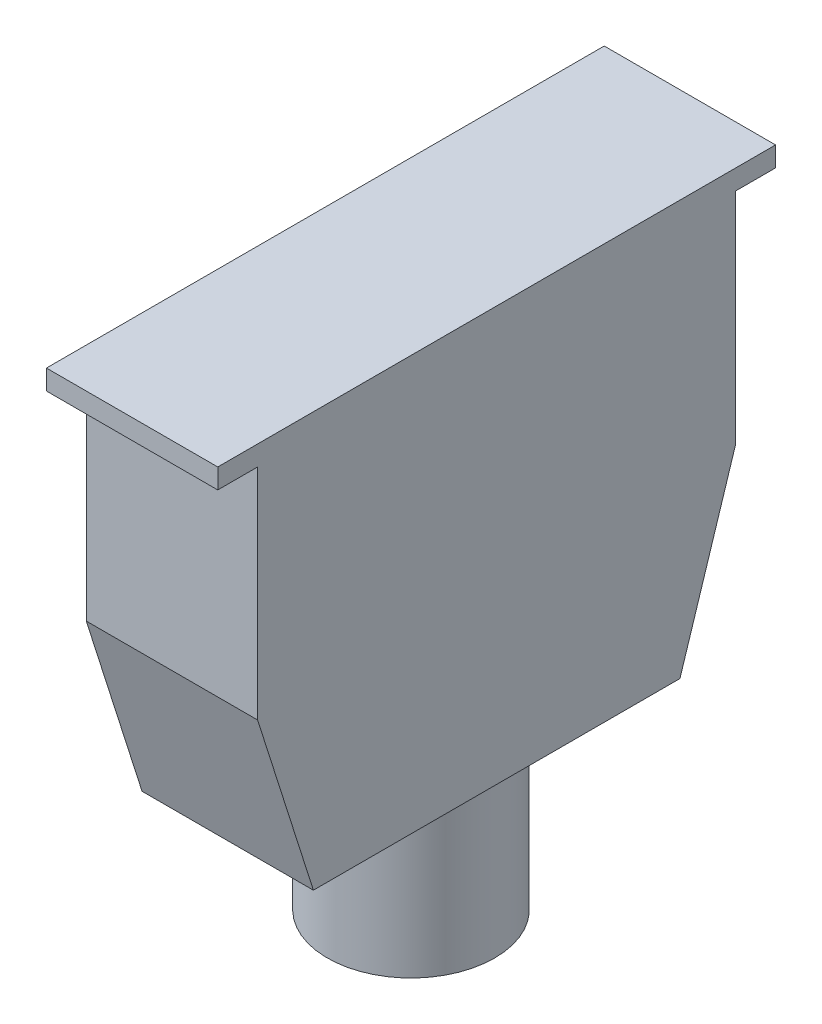
ISO-10303-21;
HEADER;
FILE_DESCRIPTION(('STEP AP214'),'2;1');
FILE_NAME('part.step','',(''),(''),'','','');
FILE_SCHEMA(('AUTOMOTIVE_DESIGN { 1 0 10303 214 1 1 1 1 }'));
ENDSEC;
DATA;
#1=APPLICATION_CONTEXT('core data for automotive mechanical design processes');
#2=APPLICATION_PROTOCOL_DEFINITION('international standard','automotive_design',2000,#1);
#3=PRODUCT_CONTEXT('',#1,'mechanical');
#4=PRODUCT('Part','Part','',(#3));
#5=PRODUCT_RELATED_PRODUCT_CATEGORY('part','',(#4));
#6=PRODUCT_DEFINITION_FORMATION('','',#4);
#7=PRODUCT_DEFINITION_CONTEXT('part definition',#1,'design');
#8=PRODUCT_DEFINITION('design','',#6,#7);
#9=PRODUCT_DEFINITION_SHAPE('','',#8);
#10=(LENGTH_UNIT() NAMED_UNIT(*) SI_UNIT(.MILLI.,.METRE.));
#11=(NAMED_UNIT(*) PLANE_ANGLE_UNIT() SI_UNIT($,.RADIAN.));
#12=(NAMED_UNIT(*) SI_UNIT($,.STERADIAN.) SOLID_ANGLE_UNIT());
#13=UNCERTAINTY_MEASURE_WITH_UNIT(LENGTH_MEASURE(1.E-05),#10,'distance_accuracy_value','');
#14=(GEOMETRIC_REPRESENTATION_CONTEXT(3) GLOBAL_UNCERTAINTY_ASSIGNED_CONTEXT((#13)) GLOBAL_UNIT_ASSIGNED_CONTEXT((#10,
#11,#12)) REPRESENTATION_CONTEXT('',''));
#15=CARTESIAN_POINT('',(0.,0.,0.));
#16=DIRECTION('',(0.,0.,1.));
#17=DIRECTION('',(1.,0.,0.));
#18=AXIS2_PLACEMENT_3D('',#15,#16,#17);
#19=CARTESIAN_POINT('',(47.,-7.6,78.5));
#20=DIRECTION('',(0.,-1.,0.));
#21=DIRECTION('',(0.,0.,-1.));
#22=AXIS2_PLACEMENT_3D('',#19,#20,#21);
#23=PLANE('',#22);
#24=DIRECTION('',(-1.,0.,0.));
#25=VECTOR('',#24,1.);
#26=CARTESIAN_POINT('',(68.5,-7.6,138.5));
#27=LINE('',#26,#25);
#28=CARTESIAN_POINT('',(68.5,-7.6,138.5));
#29=VERTEX_POINT('',#28);
#30=CARTESIAN_POINT('',(25.5,-7.6,138.5));
#31=VERTEX_POINT('',#30);
#32=EDGE_CURVE('E34',#29,#31,#27,.T.);
#33=ORIENTED_EDGE('',*,*,#32,.F.);
#34=DIRECTION('',(0.,0.,1.));
#35=VECTOR('',#34,1.);
#36=CARTESIAN_POINT('',(68.5,-7.6,8.5));
#37=LINE('',#36,#35);
#38=CARTESIAN_POINT('',(68.5,-7.6,148.5));
#39=VERTEX_POINT('',#38);
#40=EDGE_CURVE('E143',#29,#39,#37,.T.);
#41=ORIENTED_EDGE('',*,*,#40,.T.);
#42=DIRECTION('',(-1.,0.,0.));
#43=VECTOR('',#42,1.);
#44=CARTESIAN_POINT('',(68.5,-7.6,148.5));
#45=LINE('',#44,#43);
#46=CARTESIAN_POINT('',(25.5,-7.6,148.5));
#47=VERTEX_POINT('',#46);
#48=EDGE_CURVE('E112',#39,#47,#45,.T.);
#49=ORIENTED_EDGE('',*,*,#48,.T.);
#50=DIRECTION('',(0.,0.,-1.));
#51=VECTOR('',#50,1.);
#52=CARTESIAN_POINT('',(25.5,-7.6,148.5));
#53=LINE('',#52,#51);
#54=EDGE_CURVE('E129',#47,#31,#53,.T.);
#55=ORIENTED_EDGE('',*,*,#54,.T.);
#56=EDGE_LOOP('',(#33,#41,#49,#55));
#57=FACE_BOUND('',#56,.T.);
#58=ADVANCED_FACE('F17',(#57),#23,.T.);
#59=CARTESIAN_POINT('',(25.5,-7.6,148.5));
#60=DIRECTION('',(1.,0.,0.));
#61=DIRECTION('',(0.,0.,-1.));
#62=AXIS2_PLACEMENT_3D('',#59,#60,#61);
#63=PLANE('',#62);
#64=DIRECTION('',(0.,0.,-1.));
#65=VECTOR('',#64,1.);
#66=CARTESIAN_POINT('',(25.5,-2.6,148.5));
#67=LINE('',#66,#65);
#68=CARTESIAN_POINT('',(25.5,-2.6,148.5));
#69=VERTEX_POINT('',#68);
#70=CARTESIAN_POINT('',(25.5,-2.6,8.5));
#71=VERTEX_POINT('',#70);
#72=EDGE_CURVE('E102',#69,#71,#67,.T.);
#73=ORIENTED_EDGE('',*,*,#72,.T.);
#74=DIRECTION('',(0.,1.,0.));
#75=VECTOR('',#74,1.);
#76=CARTESIAN_POINT('',(25.5,-7.6,8.5));
#77=LINE('',#76,#75);
#78=CARTESIAN_POINT('',(25.5,-7.6,8.5));
#79=VERTEX_POINT('',#78);
#80=EDGE_CURVE('E11',#79,#71,#77,.T.);
#81=ORIENTED_EDGE('',*,*,#80,.F.);
#82=CARTESIAN_POINT('',(25.5,-7.6,18.5));
#83=VERTEX_POINT('',#82);
#84=EDGE_CURVE('E106',#83,#79,#53,.T.);
#85=ORIENTED_EDGE('',*,*,#84,.F.);
#86=DIRECTION('',(0.,1.,0.));
#87=VECTOR('',#86,1.);
#88=CARTESIAN_POINT('',(25.5,-31.1,18.5));
#89=LINE('',#88,#87);
#90=CARTESIAN_POINT('',(25.5,-62.6,18.5));
#91=VERTEX_POINT('',#90);
#92=EDGE_CURVE('E126',#91,#83,#89,.T.);
#93=ORIENTED_EDGE('',*,*,#92,.F.);
#94=DIRECTION('',(0.,0.952925780013262,-0.303203657276947));
#95=VECTOR('',#94,1.);
#96=CARTESIAN_POINT('',(25.5,-106.6,32.5));
#97=LINE('',#96,#95);
#98=CARTESIAN_POINT('',(25.5,-106.6,32.5));
#99=VERTEX_POINT('',#98);
#100=EDGE_CURVE('E196',#99,#91,#97,.T.);
#101=ORIENTED_EDGE('',*,*,#100,.F.);
#102=DIRECTION('',(0.,0.,-1.));
#103=VECTOR('',#102,1.);
#104=CARTESIAN_POINT('',(25.5,-106.6,138.5));
#105=LINE('',#104,#103);
#106=CARTESIAN_POINT('',(25.5,-106.6,124.5));
#107=VERTEX_POINT('',#106);
#108=EDGE_CURVE('E181',#107,#99,#105,.T.);
#109=ORIENTED_EDGE('',*,*,#108,.F.);
#110=DIRECTION('',(0.,-0.952925780013262,-0.303203657276947));
#111=VECTOR('',#110,1.);
#112=CARTESIAN_POINT('',(25.5,-62.6,138.5));
#113=LINE('',#112,#111);
#114=CARTESIAN_POINT('',(25.5,-62.6,138.5));
#115=VERTEX_POINT('',#114);
#116=EDGE_CURVE('E191',#115,#107,#113,.T.);
#117=ORIENTED_EDGE('',*,*,#116,.F.);
#118=DIRECTION('',(0.,1.,0.));
#119=VECTOR('',#118,1.);
#120=CARTESIAN_POINT('',(25.5,-31.1,138.5));
#121=LINE('',#120,#119);
#122=EDGE_CURVE('E163',#115,#31,#121,.T.);
#123=ORIENTED_EDGE('',*,*,#122,.T.);
#124=ORIENTED_EDGE('',*,*,#54,.F.);
#125=DIRECTION('',(0.,1.,0.));
#126=VECTOR('',#125,1.);
#127=CARTESIAN_POINT('',(25.5,-7.6,148.5));
#128=LINE('',#127,#126);
#129=EDGE_CURVE('E114',#47,#69,#128,.T.);
#130=ORIENTED_EDGE('',*,*,#129,.T.);
#131=EDGE_LOOP('',(#73,#81,#85,#93,#101,#109,#117,#123,#124,#130));
#132=FACE_BOUND('',#131,.T.);
#133=ADVANCED_FACE('F19',(#132),#63,.F.);
#134=CARTESIAN_POINT('',(25.5,-7.6,8.5));
#135=DIRECTION('',(0.,0.,1.));
#136=DIRECTION('',(1.,0.,0.));
#137=AXIS2_PLACEMENT_3D('',#134,#135,#136);
#138=PLANE('',#137);
#139=DIRECTION('',(1.,0.,0.));
#140=VECTOR('',#139,1.);
#141=CARTESIAN_POINT('',(25.5,-2.6,8.5));
#142=LINE('',#141,#140);
#143=CARTESIAN_POINT('',(68.5,-2.6,8.5));
#144=VERTEX_POINT('',#143);
#145=EDGE_CURVE('E120',#71,#144,#142,.T.);
#146=ORIENTED_EDGE('',*,*,#145,.T.);
#147=DIRECTION('',(0.,1.,0.));
#148=VECTOR('',#147,1.);
#149=CARTESIAN_POINT('',(68.5,-7.6,8.5));
#150=LINE('',#149,#148);
#151=CARTESIAN_POINT('',(68.5,-7.6,8.5));
#152=VERTEX_POINT('',#151);
#153=EDGE_CURVE('E26',#152,#144,#150,.T.);
#154=ORIENTED_EDGE('',*,*,#153,.F.);
#155=DIRECTION('',(1.,0.,0.));
#156=VECTOR('',#155,1.);
#157=CARTESIAN_POINT('',(25.5,-7.6,8.5));
#158=LINE('',#157,#156);
#159=EDGE_CURVE('E131',#79,#152,#158,.T.);
#160=ORIENTED_EDGE('',*,*,#159,.F.);
#161=ORIENTED_EDGE('',*,*,#80,.T.);
#162=EDGE_LOOP('',(#146,#154,#160,#161));
#163=FACE_BOUND('',#162,.T.);
#164=ADVANCED_FACE('F149',(#163),#138,.F.);
#165=CARTESIAN_POINT('',(68.5,-7.6,8.5));
#166=DIRECTION('',(-1.,0.,0.));
#167=DIRECTION('',(0.,0.,1.));
#168=AXIS2_PLACEMENT_3D('',#165,#166,#167);
#169=PLANE('',#168);
#170=DIRECTION('',(0.,0.,1.));
#171=VECTOR('',#170,1.);
#172=CARTESIAN_POINT('',(68.5,-2.6,8.5));
#173=LINE('',#172,#171);
#174=CARTESIAN_POINT('',(68.5,-2.6,148.5));
#175=VERTEX_POINT('',#174);
#176=EDGE_CURVE('E99',#144,#175,#173,.T.);
#177=ORIENTED_EDGE('',*,*,#176,.T.);
#178=DIRECTION('',(0.,1.,0.));
#179=VECTOR('',#178,1.);
#180=CARTESIAN_POINT('',(68.5,-7.6,148.5));
#181=LINE('',#180,#179);
#182=EDGE_CURVE('E110',#39,#175,#181,.T.);
#183=ORIENTED_EDGE('',*,*,#182,.F.);
#184=ORIENTED_EDGE('',*,*,#40,.F.);
#185=DIRECTION('',(0.,1.,0.));
#186=VECTOR('',#185,1.);
#187=CARTESIAN_POINT('',(68.5,-31.1,138.5));
#188=LINE('',#187,#186);
#189=CARTESIAN_POINT('',(68.5,-62.6,138.5));
#190=VERTEX_POINT('',#189);
#191=EDGE_CURVE('E158',#190,#29,#188,.T.);
#192=ORIENTED_EDGE('',*,*,#191,.F.);
#193=DIRECTION('',(0.,0.952925780013262,0.303203657276947));
#194=VECTOR('',#193,1.);
#195=CARTESIAN_POINT('',(68.5,-10.6750469043152,155.021575984991));
#196=LINE('',#195,#194);
#197=CARTESIAN_POINT('',(68.5,-106.6,124.5));
#198=VERTEX_POINT('',#197);
#199=EDGE_CURVE('E184',#198,#190,#196,.T.);
#200=ORIENTED_EDGE('',*,*,#199,.F.);
#201=DIRECTION('',(0.,0.,1.));
#202=VECTOR('',#201,1.);
#203=CARTESIAN_POINT('',(68.5,-106.6,18.5));
#204=LINE('',#203,#202);
#205=CARTESIAN_POINT('',(68.5,-106.6,32.5));
#206=VERTEX_POINT('',#205);
#207=EDGE_CURVE('E180',#206,#198,#204,.T.);
#208=ORIENTED_EDGE('',*,*,#207,.F.);
#209=DIRECTION('',(0.,-0.952925780013262,0.303203657276947));
#210=VECTOR('',#209,1.);
#211=CARTESIAN_POINT('',(68.5,-51.1253283302064,14.8489681050658));
#212=LINE('',#211,#210);
#213=CARTESIAN_POINT('',(68.5,-62.6,18.5));
#214=VERTEX_POINT('',#213);
#215=EDGE_CURVE('E154',#214,#206,#212,.T.);
#216=ORIENTED_EDGE('',*,*,#215,.F.);
#217=DIRECTION('',(0.,1.,0.));
#218=VECTOR('',#217,1.);
#219=CARTESIAN_POINT('',(68.5,-31.1,18.5));
#220=LINE('',#219,#218);
#221=CARTESIAN_POINT('',(68.5,-7.6,18.5));
#222=VERTEX_POINT('',#221);
#223=EDGE_CURVE('E152',#214,#222,#220,.T.);
#224=ORIENTED_EDGE('',*,*,#223,.T.);
#225=EDGE_CURVE('E137',#152,#222,#37,.T.);
#226=ORIENTED_EDGE('',*,*,#225,.F.);
#227=ORIENTED_EDGE('',*,*,#153,.T.);
#228=EDGE_LOOP('',(#177,#183,#184,#192,#200,#208,#216,#224,#226,#227));
#229=FACE_BOUND('',#228,.T.);
#230=ADVANCED_FACE('F117',(#229),#169,.F.);
#231=CARTESIAN_POINT('',(68.5,-7.6,148.5));
#232=DIRECTION('',(0.,0.,-1.));
#233=DIRECTION('',(-1.,0.,0.));
#234=AXIS2_PLACEMENT_3D('',#231,#232,#233);
#235=PLANE('',#234);
#236=DIRECTION('',(-1.,0.,0.));
#237=VECTOR('',#236,1.);
#238=CARTESIAN_POINT('',(68.5,-2.6,148.5));
#239=LINE('',#238,#237);
#240=EDGE_CURVE('E95',#175,#69,#239,.T.);
#241=ORIENTED_EDGE('',*,*,#240,.T.);
#242=ORIENTED_EDGE('',*,*,#129,.F.);
#243=ORIENTED_EDGE('',*,*,#48,.F.);
#244=ORIENTED_EDGE('',*,*,#182,.T.);
#245=EDGE_LOOP('',(#241,#242,#243,#244));
#246=FACE_BOUND('',#245,.T.);
#247=ADVANCED_FACE('F111',(#246),#235,.F.);
#248=DIRECTION('',(1.,0.,0.));
#249=VECTOR('',#248,1.);
#250=CARTESIAN_POINT('',(25.5,-7.6,18.5));
#251=LINE('',#250,#249);
#252=EDGE_CURVE('E42',#83,#222,#251,.T.);
#253=ORIENTED_EDGE('',*,*,#252,.F.);
#254=ORIENTED_EDGE('',*,*,#84,.T.);
#255=ORIENTED_EDGE('',*,*,#159,.T.);
#256=ORIENTED_EDGE('',*,*,#225,.T.);
#257=EDGE_LOOP('',(#253,#254,#255,#256));
#258=FACE_BOUND('',#257,.T.);
#259=ADVANCED_FACE('F146',(#258),#23,.T.);
#260=CARTESIAN_POINT('',(25.5,-31.1,18.5));
#261=DIRECTION('',(0.,0.,1.));
#262=DIRECTION('',(1.,0.,0.));
#263=AXIS2_PLACEMENT_3D('',#260,#261,#262);
#264=PLANE('',#263);
#265=ORIENTED_EDGE('',*,*,#252,.T.);
#266=ORIENTED_EDGE('',*,*,#223,.F.);
#267=DIRECTION('',(-1.,0.,0.));
#268=VECTOR('',#267,1.);
#269=CARTESIAN_POINT('',(205.124685942699,-62.6,18.5));
#270=LINE('',#269,#268);
#271=EDGE_CURVE('E194',#214,#91,#270,.T.);
#272=ORIENTED_EDGE('',*,*,#271,.T.);
#273=ORIENTED_EDGE('',*,*,#92,.T.);
#274=EDGE_LOOP('',(#265,#266,#272,#273));
#275=FACE_BOUND('',#274,.T.);
#276=ADVANCED_FACE('F228',(#275),#264,.F.);
#277=CARTESIAN_POINT('',(68.5,-31.1,138.5));
#278=DIRECTION('',(0.,0.,-1.));
#279=DIRECTION('',(-1.,0.,0.));
#280=AXIS2_PLACEMENT_3D('',#277,#278,#279);
#281=PLANE('',#280);
#282=ORIENTED_EDGE('',*,*,#32,.T.);
#283=ORIENTED_EDGE('',*,*,#122,.F.);
#284=DIRECTION('',(-1.,0.,0.));
#285=VECTOR('',#284,1.);
#286=CARTESIAN_POINT('',(205.124685942699,-62.6,138.5));
#287=LINE('',#286,#285);
#288=EDGE_CURVE('E188',#190,#115,#287,.T.);
#289=ORIENTED_EDGE('',*,*,#288,.F.);
#290=ORIENTED_EDGE('',*,*,#191,.T.);
#291=EDGE_LOOP('',(#282,#283,#289,#290));
#292=FACE_BOUND('',#291,.T.);
#293=ADVANCED_FACE('F218',(#292),#281,.F.);
#294=CARTESIAN_POINT('',(47.,-106.6,78.5));
#295=DIRECTION('',(0.,-1.,0.));
#296=DIRECTION('',(1.,0.,0.));
#297=AXIS2_PLACEMENT_3D('',#294,#295,#296);
#298=PLANE('',#297);
#299=DIRECTION('',(-1.,0.,0.));
#300=VECTOR('',#299,1.);
#301=CARTESIAN_POINT('',(47.,-106.6,32.5));
#302=LINE('',#301,#300);
#303=EDGE_CURVE('E175',#206,#99,#302,.T.);
#304=ORIENTED_EDGE('',*,*,#303,.F.);
#305=ORIENTED_EDGE('',*,*,#207,.T.);
#306=DIRECTION('',(1.,0.,0.));
#307=VECTOR('',#306,1.);
#308=CARTESIAN_POINT('',(47.,-106.6,124.5));
#309=LINE('',#308,#307);
#310=EDGE_CURVE('E177',#107,#198,#309,.T.);
#311=ORIENTED_EDGE('',*,*,#310,.F.);
#312=ORIENTED_EDGE('',*,*,#108,.T.);
#313=EDGE_LOOP('',(#304,#305,#311,#312));
#314=FACE_BOUND('',#313,.T.);
#315=CARTESIAN_POINT('',(47.,-106.6,78.5));
#316=DIRECTION('',(0.,-1.,0.));
#317=DIRECTION('',(1.,0.,0.));
#318=AXIS2_PLACEMENT_3D('',#315,#316,#317);
#319=CIRCLE('',#318,21.);
#320=CARTESIAN_POINT('',(68.,-106.6,78.5));
#321=VERTEX_POINT('',#320);
#322=EDGE_CURVE('E200',#321,#321,#319,.T.);
#323=ORIENTED_EDGE('',*,*,#322,.F.);
#324=EDGE_LOOP('',(#323));
#325=FACE_BOUND('',#324,.T.);
#326=ADVANCED_FACE('F215',(#314,#325),#298,.T.);
#327=CARTESIAN_POINT('',(205.124685942699,-62.6,138.5));
#328=DIRECTION('',(0.,0.303203657276947,-0.952925780013262));
#329=DIRECTION('',(0.,0.952925780013262,0.303203657276947));
#330=AXIS2_PLACEMENT_3D('',#327,#328,#329);
#331=PLANE('',#330);
#332=ORIENTED_EDGE('',*,*,#199,.T.);
#333=ORIENTED_EDGE('',*,*,#288,.T.);
#334=ORIENTED_EDGE('',*,*,#116,.T.);
#335=ORIENTED_EDGE('',*,*,#310,.T.);
#336=EDGE_LOOP('',(#332,#333,#334,#335));
#337=FACE_BOUND('',#336,.T.);
#338=ADVANCED_FACE('F217',(#337),#331,.F.);
#339=CARTESIAN_POINT('',(205.124685942699,-106.6,32.5));
#340=DIRECTION('',(0.,0.303203657276947,0.952925780013262));
#341=DIRECTION('',(0.,-0.952925780013262,0.303203657276947));
#342=AXIS2_PLACEMENT_3D('',#339,#340,#341);
#343=PLANE('',#342);
#344=ORIENTED_EDGE('',*,*,#215,.T.);
#345=ORIENTED_EDGE('',*,*,#303,.T.);
#346=ORIENTED_EDGE('',*,*,#100,.T.);
#347=ORIENTED_EDGE('',*,*,#271,.F.);
#348=EDGE_LOOP('',(#344,#345,#346,#347));
#349=FACE_BOUND('',#348,.T.);
#350=ADVANCED_FACE('F211',(#349),#343,.F.);
#351=CARTESIAN_POINT('',(47.,-144.6,78.5));
#352=DIRECTION('',(0.,1.,0.));
#353=DIRECTION('',(-1.,0.,0.));
#354=AXIS2_PLACEMENT_3D('',#351,#352,#353);
#355=CYLINDRICAL_SURFACE('',#354,21.);
#356=CARTESIAN_POINT('',(47.,-144.6,78.5));
#357=DIRECTION('',(0.,-1.,0.));
#358=DIRECTION('',(1.,0.,0.));
#359=AXIS2_PLACEMENT_3D('',#356,#357,#358);
#360=CIRCLE('',#359,21.);
#361=CARTESIAN_POINT('',(68.,-144.6,78.5));
#362=VERTEX_POINT('',#361);
#363=EDGE_CURVE('E199',#362,#362,#360,.T.);
#364=ORIENTED_EDGE('',*,*,#363,.F.);
#365=EDGE_LOOP('',(#364));
#366=FACE_BOUND('',#365,.T.);
#367=ORIENTED_EDGE('',*,*,#322,.T.);
#368=EDGE_LOOP('',(#367));
#369=FACE_BOUND('',#368,.T.);
#370=ADVANCED_FACE('F208',(#366,#369),#355,.T.);
#371=CARTESIAN_POINT('',(47.,-144.6,78.5));
#372=DIRECTION('',(0.,-1.,0.));
#373=DIRECTION('',(1.,0.,0.));
#374=AXIS2_PLACEMENT_3D('',#371,#372,#373);
#375=PLANE('',#374);
#376=ORIENTED_EDGE('',*,*,#363,.T.);
#377=EDGE_LOOP('',(#376));
#378=FACE_BOUND('',#377,.T.);
#379=ADVANCED_FACE('F206',(#378),#375,.T.);
#380=CARTESIAN_POINT('',(0.,-2.6,0.));
#381=DIRECTION('',(0.,1.,0.));
#382=DIRECTION('',(0.,0.,1.));
#383=AXIS2_PLACEMENT_3D('',#380,#381,#382);
#384=PLANE('',#383);
#385=ORIENTED_EDGE('',*,*,#72,.F.);
#386=ORIENTED_EDGE('',*,*,#240,.F.);
#387=ORIENTED_EDGE('',*,*,#176,.F.);
#388=ORIENTED_EDGE('',*,*,#145,.F.);
#389=EDGE_LOOP('',(#385,#386,#387,#388));
#390=FACE_BOUND('',#389,.T.);
#391=ADVANCED_FACE('F97',(#390),#384,.T.);
#392=CLOSED_SHELL('',(#58,#133,#164,#230,#247,#259,#276,#293,#326,#338,#350,#370,#379,#391));
#393=MANIFOLD_SOLID_BREP('B1',#392);
#394=ADVANCED_BREP_SHAPE_REPRESENTATION('',(#18,#393),#14);
#395=SHAPE_DEFINITION_REPRESENTATION(#9,#394);
ENDSEC;
END-ISO-10303-21;
